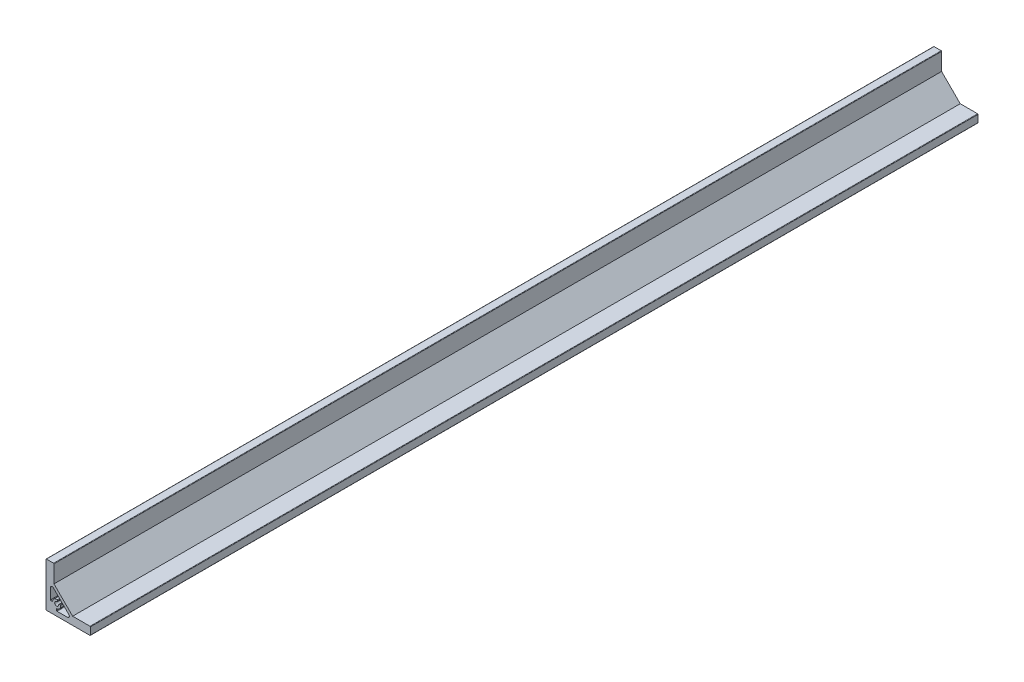
ISO-10303-21;
HEADER;
FILE_DESCRIPTION(('STEP AP214'),'2;1');
FILE_NAME('part.step','',(''),(''),'','','');
FILE_SCHEMA(('AUTOMOTIVE_DESIGN { 1 0 10303 214 1 1 1 1 }'));
ENDSEC;
DATA;
#1=APPLICATION_CONTEXT('core data for automotive mechanical design processes');
#2=APPLICATION_PROTOCOL_DEFINITION('international standard','automotive_design',2000,#1);
#3=PRODUCT_CONTEXT('',#1,'mechanical');
#4=PRODUCT('Part','Part','',(#3));
#5=PRODUCT_RELATED_PRODUCT_CATEGORY('part','',(#4));
#6=PRODUCT_DEFINITION_FORMATION('','',#4);
#7=PRODUCT_DEFINITION_CONTEXT('part definition',#1,'design');
#8=PRODUCT_DEFINITION('design','',#6,#7);
#9=PRODUCT_DEFINITION_SHAPE('','',#8);
#10=(LENGTH_UNIT() NAMED_UNIT(*) SI_UNIT(.MILLI.,.METRE.));
#11=(NAMED_UNIT(*) PLANE_ANGLE_UNIT() SI_UNIT($,.RADIAN.));
#12=(NAMED_UNIT(*) SI_UNIT($,.STERADIAN.) SOLID_ANGLE_UNIT());
#13=UNCERTAINTY_MEASURE_WITH_UNIT(LENGTH_MEASURE(1.E-05),#10,'distance_accuracy_value','');
#14=(GEOMETRIC_REPRESENTATION_CONTEXT(3) GLOBAL_UNCERTAINTY_ASSIGNED_CONTEXT((#13)) GLOBAL_UNIT_ASSIGNED_CONTEXT((#10,
#11,#12)) REPRESENTATION_CONTEXT('',''));
#15=CARTESIAN_POINT('',(0.,0.,0.));
#16=DIRECTION('',(0.,0.,1.));
#17=DIRECTION('',(1.,0.,0.));
#18=AXIS2_PLACEMENT_3D('',#15,#16,#17);
#19=CARTESIAN_POINT('',(0.,0.,1000.));
#20=DIRECTION('',(0.,0.,1.));
#21=DIRECTION('',(1.,0.,0.));
#22=AXIS2_PLACEMENT_3D('',#19,#20,#21);
#23=PLANE('',#22);
#24=DIRECTION('',(-1.,0.,0.));
#25=VECTOR('',#24,1.);
#26=CARTESIAN_POINT('',(8.99999999999999,50.,1000.));
#27=LINE('',#26,#25);
#28=CARTESIAN_POINT('',(8.49999999999999,50.,1000.));
#29=VERTEX_POINT('',#28);
#30=CARTESIAN_POINT('',(0.499999999999995,50.,1000.));
#31=VERTEX_POINT('',#30);
#32=EDGE_CURVE('E300',#29,#31,#27,.T.);
#33=ORIENTED_EDGE('',*,*,#32,.T.);
#34=CARTESIAN_POINT('',(0.499999999999995,49.5,1000.));
#35=DIRECTION('',(0.,0.,1.));
#36=DIRECTION('',(1.,0.,0.));
#37=AXIS2_PLACEMENT_3D('',#34,#35,#36);
#38=CIRCLE('',#37,0.5);
#39=CARTESIAN_POINT('',(0.,49.5,1000.));
#40=VERTEX_POINT('',#39);
#41=EDGE_CURVE('E362',#31,#40,#38,.T.);
#42=ORIENTED_EDGE('',*,*,#41,.T.);
#43=DIRECTION('',(0.,-1.,0.));
#44=VECTOR('',#43,1.);
#45=CARTESIAN_POINT('',(0.,50.,1000.));
#46=LINE('',#45,#44);
#47=CARTESIAN_POINT('',(0.,0.500000000000014,1000.));
#48=VERTEX_POINT('',#47);
#49=EDGE_CURVE('E303',#40,#48,#46,.T.);
#50=ORIENTED_EDGE('',*,*,#49,.T.);
#51=CARTESIAN_POINT('',(0.5,0.5,1000.));
#52=DIRECTION('',(0.,0.,1.));
#53=DIRECTION('',(1.,0.,0.));
#54=AXIS2_PLACEMENT_3D('',#51,#52,#53);
#55=CIRCLE('',#54,0.5);
#56=CARTESIAN_POINT('',(0.5,0.,1000.));
#57=VERTEX_POINT('',#56);
#58=EDGE_CURVE('E354',#48,#57,#55,.T.);
#59=ORIENTED_EDGE('',*,*,#58,.T.);
#60=DIRECTION('',(1.,0.,0.));
#61=VECTOR('',#60,1.);
#62=CARTESIAN_POINT('',(0.,0.,1000.));
#63=LINE('',#62,#61);
#64=CARTESIAN_POINT('',(49.5,0.,1000.));
#65=VERTEX_POINT('',#64);
#66=EDGE_CURVE('E286',#57,#65,#63,.T.);
#67=ORIENTED_EDGE('',*,*,#66,.T.);
#68=CARTESIAN_POINT('',(49.5,0.5,1000.));
#69=DIRECTION('',(0.,0.,1.));
#70=DIRECTION('',(1.,0.,0.));
#71=AXIS2_PLACEMENT_3D('',#68,#69,#70);
#72=CIRCLE('',#71,0.5);
#73=CARTESIAN_POINT('',(50.,0.5,1000.));
#74=VERTEX_POINT('',#73);
#75=EDGE_CURVE('E356',#65,#74,#72,.T.);
#76=ORIENTED_EDGE('',*,*,#75,.T.);
#77=DIRECTION('',(0.,1.,0.));
#78=VECTOR('',#77,1.);
#79=CARTESIAN_POINT('',(50.,0.,1000.));
#80=LINE('',#79,#78);
#81=CARTESIAN_POINT('',(50.,8.5,1000.));
#82=VERTEX_POINT('',#81);
#83=EDGE_CURVE('E289',#74,#82,#80,.T.);
#84=ORIENTED_EDGE('',*,*,#83,.T.);
#85=CARTESIAN_POINT('',(49.5,8.5,1000.));
#86=DIRECTION('',(0.,0.,1.));
#87=DIRECTION('',(1.,0.,0.));
#88=AXIS2_PLACEMENT_3D('',#85,#86,#87);
#89=CIRCLE('',#88,0.5);
#90=CARTESIAN_POINT('',(49.5,9.,1000.));
#91=VERTEX_POINT('',#90);
#92=EDGE_CURVE('E358',#82,#91,#89,.T.);
#93=ORIENTED_EDGE('',*,*,#92,.T.);
#94=DIRECTION('',(-1.,0.,0.));
#95=VECTOR('',#94,1.);
#96=CARTESIAN_POINT('',(50.,9.,1000.));
#97=LINE('',#96,#95);
#98=CARTESIAN_POINT('',(30.,9.,1000.));
#99=VERTEX_POINT('',#98);
#100=EDGE_CURVE('E293',#91,#99,#97,.T.);
#101=ORIENTED_EDGE('',*,*,#100,.T.);
#102=DIRECTION('',(-0.707106781186548,0.707106781186547,0.));
#103=VECTOR('',#102,1.);
#104=CARTESIAN_POINT('',(30.,9.,1000.));
#105=LINE('',#104,#103);
#106=CARTESIAN_POINT('',(8.99999999999999,30.,1000.));
#107=VERTEX_POINT('',#106);
#108=EDGE_CURVE('E295',#99,#107,#105,.T.);
#109=ORIENTED_EDGE('',*,*,#108,.T.);
#110=DIRECTION('',(0.,1.,0.));
#111=VECTOR('',#110,1.);
#112=CARTESIAN_POINT('',(8.99999999999999,30.,1000.));
#113=LINE('',#112,#111);
#114=CARTESIAN_POINT('',(8.99999999999999,49.5,1000.));
#115=VERTEX_POINT('',#114);
#116=EDGE_CURVE('E297',#107,#115,#113,.T.);
#117=ORIENTED_EDGE('',*,*,#116,.T.);
#118=CARTESIAN_POINT('',(8.49999999999999,49.5,1000.));
#119=DIRECTION('',(0.,0.,1.));
#120=DIRECTION('',(1.,0.,0.));
#121=AXIS2_PLACEMENT_3D('',#118,#119,#120);
#122=CIRCLE('',#121,0.5);
#123=EDGE_CURVE('E360',#115,#29,#122,.T.);
#124=ORIENTED_EDGE('',*,*,#123,.T.);
#125=EDGE_LOOP('',(#33,#42,#50,#59,#67,#76,#84,#93,#101,#109,#117,#124));
#126=FACE_BOUND('',#125,.T.);
#127=CARTESIAN_POINT('',(12.,12.,1000.));
#128=DIRECTION('',(0.,0.,-1.));
#129=DIRECTION('',(1.,0.,0.));
#130=AXIS2_PLACEMENT_3D('',#127,#128,#129);
#131=CIRCLE('',#130,4.5);
#132=CARTESIAN_POINT('',(16.4581599050562,12.6122174948079,1000.));
#133=VERTEX_POINT('',#132);
#134=CARTESIAN_POINT('',(12.,7.49999999999997,1000.));
#135=VERTEX_POINT('',#134);
#136=EDGE_CURVE('E251',#133,#135,#131,.T.);
#137=ORIENTED_EDGE('',*,*,#136,.F.);
#138=CARTESIAN_POINT('',(15.9628088044944,12.5441933287182,1000.));
#139=DIRECTION('',(0.,0.,1.));
#140=DIRECTION('',(1.,0.,0.));
#141=AXIS2_PLACEMENT_3D('',#138,#139,#140);
#142=CIRCLE('',#141,0.5);
#143=CARTESIAN_POINT('',(15.8333992819432,13.0271562418627,1000.));
#144=VERTEX_POINT('',#143);
#145=EDGE_CURVE('E369',#133,#144,#142,.T.);
#146=ORIENTED_EDGE('',*,*,#145,.T.);
#147=DIRECTION('',(0.965925826289068,0.258819045102522,0.));
#148=VECTOR('',#147,1.);
#149=CARTESIAN_POINT('',(16.3466662183008,13.1646857029613,1000.));
#150=LINE('',#149,#148);
#151=CARTESIAN_POINT('',(14.5628908328919,12.6867245289625,1000.));
#152=VERTEX_POINT('',#151);
#153=EDGE_CURVE('E248',#152,#144,#150,.T.);
#154=ORIENTED_EDGE('',*,*,#153,.F.);
#155=CARTESIAN_POINT('',(14.6923003554431,12.2037616158179,1000.));
#156=DIRECTION('',(0.,0.,1.));
#157=DIRECTION('',(1.,0.,0.));
#158=AXIS2_PLACEMENT_3D('',#155,#156,#157);
#159=CIRCLE('',#158,0.5);
#160=CARTESIAN_POINT('',(14.1937262155462,12.1660279832591,1000.));
#161=VERTEX_POINT('',#160);
#162=EDGE_CURVE('E364',#152,#161,#159,.T.);
#163=ORIENTED_EDGE('',*,*,#162,.T.);
#164=CARTESIAN_POINT('',(12.,12.,1000.));
#165=DIRECTION('',(0.,0.,1.));
#166=DIRECTION('',(1.,0.,0.));
#167=AXIS2_PLACEMENT_3D('',#164,#165,#166);
#168=CIRCLE('',#167,2.20000000000001);
#169=CARTESIAN_POINT('',(12.1660279832591,14.1937262155462,1000.));
#170=VERTEX_POINT('',#169);
#171=EDGE_CURVE('E242',#170,#161,#168,.T.);
#172=ORIENTED_EDGE('',*,*,#171,.F.);
#173=CARTESIAN_POINT('',(12.203761615818,14.6923003554431,1000.));
#174=DIRECTION('',(0.,0.,1.));
#175=DIRECTION('',(1.,0.,0.));
#176=AXIS2_PLACEMENT_3D('',#173,#174,#175);
#177=CIRCLE('',#176,0.5);
#178=CARTESIAN_POINT('',(12.6867245289625,14.5628908328919,1000.));
#179=VERTEX_POINT('',#178);
#180=EDGE_CURVE('E366',#170,#179,#177,.T.);
#181=ORIENTED_EDGE('',*,*,#180,.T.);
#182=DIRECTION('',(-0.258819045102518,-0.965925826289069,0.));
#183=VECTOR('',#182,1.);
#184=CARTESIAN_POINT('',(12.5694018992255,14.1250368178359,1000.));
#185=LINE('',#184,#183);
#186=CARTESIAN_POINT('',(13.0271562418627,15.8333992819432,1000.));
#187=VERTEX_POINT('',#186);
#188=EDGE_CURVE('E239',#187,#179,#185,.T.);
#189=ORIENTED_EDGE('',*,*,#188,.F.);
#190=CARTESIAN_POINT('',(12.5441933287182,15.9628088044944,1000.));
#191=DIRECTION('',(0.,0.,1.));
#192=DIRECTION('',(1.,0.,0.));
#193=AXIS2_PLACEMENT_3D('',#190,#191,#192);
#194=CIRCLE('',#193,0.5);
#195=CARTESIAN_POINT('',(12.6122174948079,16.4581599050562,1000.));
#196=VERTEX_POINT('',#195);
#197=EDGE_CURVE('E238',#187,#196,#194,.T.);
#198=ORIENTED_EDGE('',*,*,#197,.T.);
#199=CARTESIAN_POINT('',(12.,12.,1000.));
#200=DIRECTION('',(0.,0.,-1.));
#201=DIRECTION('',(1.,0.,0.));
#202=AXIS2_PLACEMENT_3D('',#199,#200,#201);
#203=CIRCLE('',#202,4.5);
#204=CARTESIAN_POINT('',(7.49999999999997,12.,1000.));
#205=VERTEX_POINT('',#204);
#206=EDGE_CURVE('E222',#205,#196,#203,.T.);
#207=ORIENTED_EDGE('',*,*,#206,.F.);
#208=DIRECTION('',(1.,0.,0.));
#209=VECTOR('',#208,1.);
#210=CARTESIAN_POINT('',(7.49999999999997,12.,1000.));
#211=LINE('',#210,#209);
#212=CARTESIAN_POINT('',(5.49999999999999,12.,1000.));
#213=VERTEX_POINT('',#212);
#214=EDGE_CURVE('E210',#213,#205,#211,.T.);
#215=ORIENTED_EDGE('',*,*,#214,.F.);
#216=CARTESIAN_POINT('',(5.49999999999999,12.5,1000.));
#217=DIRECTION('',(0.,0.,1.));
#218=DIRECTION('',(1.,0.,0.));
#219=AXIS2_PLACEMENT_3D('',#216,#217,#218);
#220=CIRCLE('',#219,0.5);
#221=CARTESIAN_POINT('',(4.99999999999999,12.5,1000.));
#222=VERTEX_POINT('',#221);
#223=EDGE_CURVE('E423',#213,#222,#220,.F.);
#224=ORIENTED_EDGE('',*,*,#223,.T.);
#225=DIRECTION('',(0.,-1.,0.));
#226=VECTOR('',#225,1.);
#227=CARTESIAN_POINT('',(4.99999999999999,12.,1000.));
#228=LINE('',#227,#226);
#229=CARTESIAN_POINT('',(4.99999999999999,24.3632467631853,1000.));
#230=VERTEX_POINT('',#229);
#231=EDGE_CURVE('E223',#230,#222,#228,.T.);
#232=ORIENTED_EDGE('',*,*,#231,.F.);
#233=CARTESIAN_POINT('',(6.99999999999999,24.3632467631853,1000.));
#234=DIRECTION('',(0.,0.,1.));
#235=DIRECTION('',(1.,0.,0.));
#236=AXIS2_PLACEMENT_3D('',#233,#234,#235);
#237=CIRCLE('',#236,2.);
#238=CARTESIAN_POINT('',(8.41421356237308,25.7774603255584,1000.));
#239=VERTEX_POINT('',#238);
#240=EDGE_CURVE('E9',#230,#239,#237,.F.);
#241=ORIENTED_EDGE('',*,*,#240,.T.);
#242=DIRECTION('',(-0.707106781186548,0.707106781186547,0.));
#243=VECTOR('',#242,1.);
#244=CARTESIAN_POINT('',(4.99999999999999,29.1916738879315,1000.));
#245=LINE('',#244,#243);
#246=CARTESIAN_POINT('',(25.7774603255584,8.4142135623731,1000.));
#247=VERTEX_POINT('',#246);
#248=EDGE_CURVE('E283',#247,#239,#245,.T.);
#249=ORIENTED_EDGE('',*,*,#248,.F.);
#250=CARTESIAN_POINT('',(24.3632467631853,7.,1000.));
#251=DIRECTION('',(0.,0.,1.));
#252=DIRECTION('',(1.,0.,0.));
#253=AXIS2_PLACEMENT_3D('',#250,#251,#252);
#254=CIRCLE('',#253,2.);
#255=CARTESIAN_POINT('',(24.3632467631853,5.,1000.));
#256=VERTEX_POINT('',#255);
#257=EDGE_CURVE('E436',#247,#256,#254,.F.);
#258=ORIENTED_EDGE('',*,*,#257,.T.);
#259=DIRECTION('',(1.,0.,0.));
#260=VECTOR('',#259,1.);
#261=CARTESIAN_POINT('',(29.1916738879315,5.,1000.));
#262=LINE('',#261,#260);
#263=CARTESIAN_POINT('',(12.5,5.,1000.));
#264=VERTEX_POINT('',#263);
#265=EDGE_CURVE('E256',#264,#256,#262,.T.);
#266=ORIENTED_EDGE('',*,*,#265,.F.);
#267=CARTESIAN_POINT('',(12.5,5.5,1000.));
#268=DIRECTION('',(0.,0.,1.));
#269=DIRECTION('',(1.,0.,0.));
#270=AXIS2_PLACEMENT_3D('',#267,#268,#269);
#271=CIRCLE('',#270,0.5);
#272=CARTESIAN_POINT('',(12.,5.5,1000.));
#273=VERTEX_POINT('',#272);
#274=EDGE_CURVE('E419',#264,#273,#271,.F.);
#275=ORIENTED_EDGE('',*,*,#274,.T.);
#276=DIRECTION('',(0.,-1.,0.));
#277=VECTOR('',#276,1.);
#278=CARTESIAN_POINT('',(12.,5.,1000.));
#279=LINE('',#278,#277);
#280=EDGE_CURVE('E253',#135,#273,#279,.T.);
#281=ORIENTED_EDGE('',*,*,#280,.F.);
#282=EDGE_LOOP('',(#137,#146,#154,#163,#172,#181,#189,#198,#207,#215,#224,#232,#241,#249,#258,
#266,#275,#281));
#283=FACE_BOUND('',#282,.T.);
#284=ADVANCED_FACE('F15',(#126,#283),#23,.T.);
#285=CARTESIAN_POINT('',(0.,0.,0.));
#286=DIRECTION('',(0.,0.,1.));
#287=DIRECTION('',(1.,0.,0.));
#288=AXIS2_PLACEMENT_3D('',#285,#286,#287);
#289=PLANE('',#288);
#290=DIRECTION('',(0.,-1.,0.));
#291=VECTOR('',#290,1.);
#292=CARTESIAN_POINT('',(0.,50.,0.));
#293=LINE('',#292,#291);
#294=CARTESIAN_POINT('',(0.,49.5,0.));
#295=VERTEX_POINT('',#294);
#296=CARTESIAN_POINT('',(0.,0.500000000000014,0.));
#297=VERTEX_POINT('',#296);
#298=EDGE_CURVE('E290',#295,#297,#293,.T.);
#299=ORIENTED_EDGE('',*,*,#298,.F.);
#300=CARTESIAN_POINT('',(0.499999999999995,49.5,0.));
#301=DIRECTION('',(0.,0.,1.));
#302=DIRECTION('',(1.,0.,0.));
#303=AXIS2_PLACEMENT_3D('',#300,#301,#302);
#304=CIRCLE('',#303,0.5);
#305=CARTESIAN_POINT('',(0.499999999999995,50.,0.));
#306=VERTEX_POINT('',#305);
#307=EDGE_CURVE('E342',#295,#306,#304,.F.);
#308=ORIENTED_EDGE('',*,*,#307,.T.);
#309=DIRECTION('',(-1.,0.,0.));
#310=VECTOR('',#309,1.);
#311=CARTESIAN_POINT('',(8.99999999999999,50.,0.));
#312=LINE('',#311,#310);
#313=CARTESIAN_POINT('',(8.49999999999999,50.,0.));
#314=VERTEX_POINT('',#313);
#315=EDGE_CURVE('E319',#314,#306,#312,.T.);
#316=ORIENTED_EDGE('',*,*,#315,.F.);
#317=CARTESIAN_POINT('',(8.49999999999999,49.5,0.));
#318=DIRECTION('',(0.,0.,1.));
#319=DIRECTION('',(1.,0.,0.));
#320=AXIS2_PLACEMENT_3D('',#317,#318,#319);
#321=CIRCLE('',#320,0.5);
#322=CARTESIAN_POINT('',(8.99999999999999,49.5,0.));
#323=VERTEX_POINT('',#322);
#324=EDGE_CURVE('E340',#314,#323,#321,.F.);
#325=ORIENTED_EDGE('',*,*,#324,.T.);
#326=DIRECTION('',(0.,1.,0.));
#327=VECTOR('',#326,1.);
#328=CARTESIAN_POINT('',(8.99999999999999,30.,0.));
#329=LINE('',#328,#327);
#330=CARTESIAN_POINT('',(8.99999999999999,30.,0.));
#331=VERTEX_POINT('',#330);
#332=EDGE_CURVE('E316',#331,#323,#329,.T.);
#333=ORIENTED_EDGE('',*,*,#332,.F.);
#334=DIRECTION('',(-0.707106781186548,0.707106781186547,0.));
#335=VECTOR('',#334,1.);
#336=CARTESIAN_POINT('',(30.,9.,0.));
#337=LINE('',#336,#335);
#338=CARTESIAN_POINT('',(30.,9.,0.));
#339=VERTEX_POINT('',#338);
#340=EDGE_CURVE('E314',#339,#331,#337,.T.);
#341=ORIENTED_EDGE('',*,*,#340,.F.);
#342=DIRECTION('',(-1.,0.,0.));
#343=VECTOR('',#342,1.);
#344=CARTESIAN_POINT('',(50.,9.,0.));
#345=LINE('',#344,#343);
#346=CARTESIAN_POINT('',(49.5,9.,0.));
#347=VERTEX_POINT('',#346);
#348=EDGE_CURVE('E312',#347,#339,#345,.T.);
#349=ORIENTED_EDGE('',*,*,#348,.F.);
#350=CARTESIAN_POINT('',(49.5,8.5,0.));
#351=DIRECTION('',(0.,0.,1.));
#352=DIRECTION('',(1.,0.,0.));
#353=AXIS2_PLACEMENT_3D('',#350,#351,#352);
#354=CIRCLE('',#353,0.5);
#355=CARTESIAN_POINT('',(50.,8.5,0.));
#356=VERTEX_POINT('',#355);
#357=EDGE_CURVE('E338',#347,#356,#354,.F.);
#358=ORIENTED_EDGE('',*,*,#357,.T.);
#359=DIRECTION('',(0.,1.,0.));
#360=VECTOR('',#359,1.);
#361=CARTESIAN_POINT('',(50.,0.,0.));
#362=LINE('',#361,#360);
#363=CARTESIAN_POINT('',(50.,0.5,0.));
#364=VERTEX_POINT('',#363);
#365=EDGE_CURVE('E309',#364,#356,#362,.T.);
#366=ORIENTED_EDGE('',*,*,#365,.F.);
#367=CARTESIAN_POINT('',(49.5,0.5,0.));
#368=DIRECTION('',(0.,0.,1.));
#369=DIRECTION('',(1.,0.,0.));
#370=AXIS2_PLACEMENT_3D('',#367,#368,#369);
#371=CIRCLE('',#370,0.5);
#372=CARTESIAN_POINT('',(49.5,0.,0.));
#373=VERTEX_POINT('',#372);
#374=EDGE_CURVE('E336',#364,#373,#371,.F.);
#375=ORIENTED_EDGE('',*,*,#374,.T.);
#376=DIRECTION('',(1.,0.,0.));
#377=VECTOR('',#376,1.);
#378=CARTESIAN_POINT('',(0.,0.,0.));
#379=LINE('',#378,#377);
#380=CARTESIAN_POINT('',(0.5,0.,0.));
#381=VERTEX_POINT('',#380);
#382=EDGE_CURVE('E232',#381,#373,#379,.T.);
#383=ORIENTED_EDGE('',*,*,#382,.F.);
#384=CARTESIAN_POINT('',(0.5,0.5,0.));
#385=DIRECTION('',(0.,0.,1.));
#386=DIRECTION('',(1.,0.,0.));
#387=AXIS2_PLACEMENT_3D('',#384,#385,#386);
#388=CIRCLE('',#387,0.5);
#389=EDGE_CURVE('E334',#381,#297,#388,.F.);
#390=ORIENTED_EDGE('',*,*,#389,.T.);
#391=EDGE_LOOP('',(#299,#308,#316,#325,#333,#341,#349,#358,#366,#375,#383,#390));
#392=FACE_BOUND('',#391,.T.);
#393=DIRECTION('',(0.965925826289068,0.258819045102522,0.));
#394=VECTOR('',#393,1.);
#395=CARTESIAN_POINT('',(16.3466662183008,13.1646857029613,0.));
#396=LINE('',#395,#394);
#397=CARTESIAN_POINT('',(14.5628908328919,12.6867245289625,0.));
#398=VERTEX_POINT('',#397);
#399=CARTESIAN_POINT('',(15.8333992819432,13.0271562418627,0.));
#400=VERTEX_POINT('',#399);
#401=EDGE_CURVE('E272',#398,#400,#396,.T.);
#402=ORIENTED_EDGE('',*,*,#401,.T.);
#403=CARTESIAN_POINT('',(15.9628088044944,12.5441933287182,0.));
#404=DIRECTION('',(0.,0.,1.));
#405=DIRECTION('',(1.,0.,0.));
#406=AXIS2_PLACEMENT_3D('',#403,#404,#405);
#407=CIRCLE('',#406,0.5);
#408=CARTESIAN_POINT('',(16.4581599050562,12.6122174948079,0.));
#409=VERTEX_POINT('',#408);
#410=EDGE_CURVE('E350',#400,#409,#407,.F.);
#411=ORIENTED_EDGE('',*,*,#410,.T.);
#412=CARTESIAN_POINT('',(12.,12.,0.));
#413=DIRECTION('',(0.,0.,-1.));
#414=DIRECTION('',(1.,0.,0.));
#415=AXIS2_PLACEMENT_3D('',#412,#413,#414);
#416=CIRCLE('',#415,4.5);
#417=CARTESIAN_POINT('',(12.,7.49999999999997,0.));
#418=VERTEX_POINT('',#417);
#419=EDGE_CURVE('E275',#409,#418,#416,.T.);
#420=ORIENTED_EDGE('',*,*,#419,.T.);
#421=DIRECTION('',(0.,-1.,0.));
#422=VECTOR('',#421,1.);
#423=CARTESIAN_POINT('',(12.,5.,0.));
#424=LINE('',#423,#422);
#425=CARTESIAN_POINT('',(12.,5.5,0.));
#426=VERTEX_POINT('',#425);
#427=EDGE_CURVE('E277',#418,#426,#424,.T.);
#428=ORIENTED_EDGE('',*,*,#427,.T.);
#429=CARTESIAN_POINT('',(12.5,5.5,0.));
#430=DIRECTION('',(0.,0.,1.));
#431=DIRECTION('',(1.,0.,0.));
#432=AXIS2_PLACEMENT_3D('',#429,#430,#431);
#433=CIRCLE('',#432,0.5);
#434=CARTESIAN_POINT('',(12.5,5.,0.));
#435=VERTEX_POINT('',#434);
#436=EDGE_CURVE('E417',#426,#435,#433,.T.);
#437=ORIENTED_EDGE('',*,*,#436,.T.);
#438=DIRECTION('',(1.,0.,0.));
#439=VECTOR('',#438,1.);
#440=CARTESIAN_POINT('',(29.1916738879315,5.,0.));
#441=LINE('',#440,#439);
#442=CARTESIAN_POINT('',(24.3632467631853,5.,0.));
#443=VERTEX_POINT('',#442);
#444=EDGE_CURVE('E280',#435,#443,#441,.T.);
#445=ORIENTED_EDGE('',*,*,#444,.T.);
#446=CARTESIAN_POINT('',(24.3632467631853,7.,0.));
#447=DIRECTION('',(0.,0.,1.));
#448=DIRECTION('',(1.,0.,0.));
#449=AXIS2_PLACEMENT_3D('',#446,#447,#448);
#450=CIRCLE('',#449,2.);
#451=CARTESIAN_POINT('',(25.7774603255584,8.4142135623731,0.));
#452=VERTEX_POINT('',#451);
#453=EDGE_CURVE('E434',#443,#452,#450,.T.);
#454=ORIENTED_EDGE('',*,*,#453,.T.);
#455=DIRECTION('',(-0.707106781186548,0.707106781186547,0.));
#456=VECTOR('',#455,1.);
#457=CARTESIAN_POINT('',(4.99999999999999,29.1916738879315,0.));
#458=LINE('',#457,#456);
#459=CARTESIAN_POINT('',(8.41421356237308,25.7774603255584,0.));
#460=VERTEX_POINT('',#459);
#461=EDGE_CURVE('E259',#452,#460,#458,.T.);
#462=ORIENTED_EDGE('',*,*,#461,.T.);
#463=CARTESIAN_POINT('',(6.99999999999999,24.3632467631853,0.));
#464=DIRECTION('',(0.,0.,1.));
#465=DIRECTION('',(1.,0.,0.));
#466=AXIS2_PLACEMENT_3D('',#463,#464,#465);
#467=CIRCLE('',#466,2.);
#468=CARTESIAN_POINT('',(4.99999999999999,24.3632467631853,0.));
#469=VERTEX_POINT('',#468);
#470=EDGE_CURVE('E23',#460,#469,#467,.T.);
#471=ORIENTED_EDGE('',*,*,#470,.T.);
#472=DIRECTION('',(0.,-1.,0.));
#473=VECTOR('',#472,1.);
#474=CARTESIAN_POINT('',(4.99999999999999,12.,0.));
#475=LINE('',#474,#473);
#476=CARTESIAN_POINT('',(4.99999999999999,12.5,0.));
#477=VERTEX_POINT('',#476);
#478=EDGE_CURVE('E261',#469,#477,#475,.T.);
#479=ORIENTED_EDGE('',*,*,#478,.T.);
#480=CARTESIAN_POINT('',(5.49999999999999,12.5,0.));
#481=DIRECTION('',(0.,0.,1.));
#482=DIRECTION('',(1.,0.,0.));
#483=AXIS2_PLACEMENT_3D('',#480,#481,#482);
#484=CIRCLE('',#483,0.5);
#485=CARTESIAN_POINT('',(5.49999999999999,12.,0.));
#486=VERTEX_POINT('',#485);
#487=EDGE_CURVE('E421',#477,#486,#484,.T.);
#488=ORIENTED_EDGE('',*,*,#487,.T.);
#489=DIRECTION('',(1.,0.,0.));
#490=VECTOR('',#489,1.);
#491=CARTESIAN_POINT('',(7.49999999999997,12.,0.));
#492=LINE('',#491,#490);
#493=CARTESIAN_POINT('',(7.49999999999997,12.,0.));
#494=VERTEX_POINT('',#493);
#495=EDGE_CURVE('E263',#486,#494,#492,.T.);
#496=ORIENTED_EDGE('',*,*,#495,.T.);
#497=CARTESIAN_POINT('',(12.,12.,0.));
#498=DIRECTION('',(0.,0.,-1.));
#499=DIRECTION('',(1.,0.,0.));
#500=AXIS2_PLACEMENT_3D('',#497,#498,#499);
#501=CIRCLE('',#500,4.5);
#502=CARTESIAN_POINT('',(12.6122174948079,16.4581599050562,0.));
#503=VERTEX_POINT('',#502);
#504=EDGE_CURVE('E231',#494,#503,#501,.T.);
#505=ORIENTED_EDGE('',*,*,#504,.T.);
#506=CARTESIAN_POINT('',(12.5441933287182,15.9628088044944,0.));
#507=DIRECTION('',(0.,0.,1.));
#508=DIRECTION('',(1.,0.,0.));
#509=AXIS2_PLACEMENT_3D('',#506,#507,#508);
#510=CIRCLE('',#509,0.5);
#511=CARTESIAN_POINT('',(13.0271562418627,15.8333992819432,0.));
#512=VERTEX_POINT('',#511);
#513=EDGE_CURVE('E348',#503,#512,#510,.F.);
#514=ORIENTED_EDGE('',*,*,#513,.T.);
#515=DIRECTION('',(-0.258819045102518,-0.965925826289069,0.));
#516=VECTOR('',#515,1.);
#517=CARTESIAN_POINT('',(12.5694018992255,14.1250368178359,0.));
#518=LINE('',#517,#516);
#519=CARTESIAN_POINT('',(12.6867245289625,14.5628908328919,0.));
#520=VERTEX_POINT('',#519);
#521=EDGE_CURVE('E266',#512,#520,#518,.T.);
#522=ORIENTED_EDGE('',*,*,#521,.T.);
#523=CARTESIAN_POINT('',(12.203761615818,14.6923003554431,0.));
#524=DIRECTION('',(0.,0.,1.));
#525=DIRECTION('',(1.,0.,0.));
#526=AXIS2_PLACEMENT_3D('',#523,#524,#525);
#527=CIRCLE('',#526,0.5);
#528=CARTESIAN_POINT('',(12.1660279832591,14.1937262155462,0.));
#529=VERTEX_POINT('',#528);
#530=EDGE_CURVE('E346',#520,#529,#527,.F.);
#531=ORIENTED_EDGE('',*,*,#530,.T.);
#532=CARTESIAN_POINT('',(12.,12.,0.));
#533=DIRECTION('',(0.,0.,1.));
#534=DIRECTION('',(1.,0.,0.));
#535=AXIS2_PLACEMENT_3D('',#532,#533,#534);
#536=CIRCLE('',#535,2.20000000000001);
#537=CARTESIAN_POINT('',(14.1937262155462,12.1660279832591,0.));
#538=VERTEX_POINT('',#537);
#539=EDGE_CURVE('E269',#529,#538,#536,.T.);
#540=ORIENTED_EDGE('',*,*,#539,.T.);
#541=CARTESIAN_POINT('',(14.6923003554431,12.2037616158179,0.));
#542=DIRECTION('',(0.,0.,1.));
#543=DIRECTION('',(1.,0.,0.));
#544=AXIS2_PLACEMENT_3D('',#541,#542,#543);
#545=CIRCLE('',#544,0.5);
#546=EDGE_CURVE('E344',#538,#398,#545,.F.);
#547=ORIENTED_EDGE('',*,*,#546,.T.);
#548=EDGE_LOOP('',(#402,#411,#420,#428,#437,#445,#454,#462,#471,#479,#488,#496,#505,#514,#522,
#531,#540,#547));
#549=FACE_BOUND('',#548,.T.);
#550=ADVANCED_FACE('F451',(#392,#549),#289,.F.);
#551=CARTESIAN_POINT('',(0.,0.,1000.));
#552=DIRECTION('',(0.,1.,0.));
#553=DIRECTION('',(0.,0.,1.));
#554=AXIS2_PLACEMENT_3D('',#551,#552,#553);
#555=PLANE('',#554);
#556=ORIENTED_EDGE('',*,*,#382,.T.);
#557=DIRECTION('',(0.,0.,-1.));
#558=VECTOR('',#557,1.);
#559=CARTESIAN_POINT('',(49.5,0.,1000.));
#560=LINE('',#559,#558);
#561=EDGE_CURVE('E415',#373,#65,#560,.F.);
#562=ORIENTED_EDGE('',*,*,#561,.T.);
#563=ORIENTED_EDGE('',*,*,#66,.F.);
#564=DIRECTION('',(0.,0.,-1.));
#565=VECTOR('',#564,1.);
#566=CARTESIAN_POINT('',(0.5,0.,1000.));
#567=LINE('',#566,#565);
#568=EDGE_CURVE('E412',#57,#381,#567,.T.);
#569=ORIENTED_EDGE('',*,*,#568,.T.);
#570=EDGE_LOOP('',(#556,#562,#563,#569));
#571=FACE_BOUND('',#570,.T.);
#572=ADVANCED_FACE('F489',(#571),#555,.F.);
#573=CARTESIAN_POINT('',(50.,0.,1000.));
#574=DIRECTION('',(-1.,0.,0.));
#575=DIRECTION('',(0.,0.,1.));
#576=AXIS2_PLACEMENT_3D('',#573,#574,#575);
#577=PLANE('',#576);
#578=ORIENTED_EDGE('',*,*,#365,.T.);
#579=DIRECTION('',(0.,0.,-1.));
#580=VECTOR('',#579,1.);
#581=CARTESIAN_POINT('',(50.,8.5,1000.));
#582=LINE('',#581,#580);
#583=EDGE_CURVE('E410',#356,#82,#582,.F.);
#584=ORIENTED_EDGE('',*,*,#583,.T.);
#585=ORIENTED_EDGE('',*,*,#83,.F.);
#586=DIRECTION('',(0.,0.,-1.));
#587=VECTOR('',#586,1.);
#588=CARTESIAN_POINT('',(50.,0.5,1000.));
#589=LINE('',#588,#587);
#590=EDGE_CURVE('E407',#74,#364,#589,.T.);
#591=ORIENTED_EDGE('',*,*,#590,.T.);
#592=EDGE_LOOP('',(#578,#584,#585,#591));
#593=FACE_BOUND('',#592,.T.);
#594=ADVANCED_FACE('F514',(#593),#577,.F.);
#595=CARTESIAN_POINT('',(50.,9.,1000.));
#596=DIRECTION('',(0.,-1.,0.));
#597=DIRECTION('',(0.,0.,-1.));
#598=AXIS2_PLACEMENT_3D('',#595,#596,#597);
#599=PLANE('',#598);
#600=ORIENTED_EDGE('',*,*,#100,.F.);
#601=DIRECTION('',(0.,0.,-1.));
#602=VECTOR('',#601,1.);
#603=CARTESIAN_POINT('',(49.5,9.,1000.));
#604=LINE('',#603,#602);
#605=EDGE_CURVE('E404',#91,#347,#604,.T.);
#606=ORIENTED_EDGE('',*,*,#605,.T.);
#607=ORIENTED_EDGE('',*,*,#348,.T.);
#608=DIRECTION('',(0.,0.,-1.));
#609=VECTOR('',#608,1.);
#610=CARTESIAN_POINT('',(30.,9.,1000.));
#611=LINE('',#610,#609);
#612=EDGE_CURVE('E326',#99,#339,#611,.T.);
#613=ORIENTED_EDGE('',*,*,#612,.F.);
#614=EDGE_LOOP('',(#600,#606,#607,#613));
#615=FACE_BOUND('',#614,.T.);
#616=ADVANCED_FACE('F510',(#615),#599,.F.);
#617=CARTESIAN_POINT('',(30.,9.,1000.));
#618=DIRECTION('',(-0.707106781186547,-0.707106781186548,0.));
#619=DIRECTION('',(0.707106781186548,-0.707106781186547,0.));
#620=AXIS2_PLACEMENT_3D('',#617,#618,#619);
#621=PLANE('',#620);
#622=ORIENTED_EDGE('',*,*,#340,.T.);
#623=DIRECTION('',(0.,0.,-1.));
#624=VECTOR('',#623,1.);
#625=CARTESIAN_POINT('',(8.99999999999999,30.,1000.));
#626=LINE('',#625,#624);
#627=EDGE_CURVE('E306',#107,#331,#626,.T.);
#628=ORIENTED_EDGE('',*,*,#627,.F.);
#629=ORIENTED_EDGE('',*,*,#108,.F.);
#630=ORIENTED_EDGE('',*,*,#612,.T.);
#631=EDGE_LOOP('',(#622,#628,#629,#630));
#632=FACE_BOUND('',#631,.T.);
#633=ADVANCED_FACE('F506',(#632),#621,.F.);
#634=CARTESIAN_POINT('',(8.99999999999999,30.,1000.));
#635=DIRECTION('',(-1.,0.,0.));
#636=DIRECTION('',(0.,0.,1.));
#637=AXIS2_PLACEMENT_3D('',#634,#635,#636);
#638=PLANE('',#637);
#639=ORIENTED_EDGE('',*,*,#332,.T.);
#640=DIRECTION('',(0.,0.,-1.));
#641=VECTOR('',#640,1.);
#642=CARTESIAN_POINT('',(8.99999999999999,49.5,1000.));
#643=LINE('',#642,#641);
#644=EDGE_CURVE('E402',#323,#115,#643,.F.);
#645=ORIENTED_EDGE('',*,*,#644,.T.);
#646=ORIENTED_EDGE('',*,*,#116,.F.);
#647=ORIENTED_EDGE('',*,*,#627,.T.);
#648=EDGE_LOOP('',(#639,#645,#646,#647));
#649=FACE_BOUND('',#648,.T.);
#650=ADVANCED_FACE('F502',(#649),#638,.F.);
#651=CARTESIAN_POINT('',(8.99999999999999,50.,1000.));
#652=DIRECTION('',(0.,-1.,0.));
#653=DIRECTION('',(0.,0.,-1.));
#654=AXIS2_PLACEMENT_3D('',#651,#652,#653);
#655=PLANE('',#654);
#656=ORIENTED_EDGE('',*,*,#315,.T.);
#657=DIRECTION('',(0.,0.,-1.));
#658=VECTOR('',#657,1.);
#659=CARTESIAN_POINT('',(0.499999999999995,50.,1000.));
#660=LINE('',#659,#658);
#661=EDGE_CURVE('E400',#306,#31,#660,.F.);
#662=ORIENTED_EDGE('',*,*,#661,.T.);
#663=ORIENTED_EDGE('',*,*,#32,.F.);
#664=DIRECTION('',(0.,0.,-1.));
#665=VECTOR('',#664,1.);
#666=CARTESIAN_POINT('',(8.49999999999999,50.,1000.));
#667=LINE('',#666,#665);
#668=EDGE_CURVE('E397',#29,#314,#667,.T.);
#669=ORIENTED_EDGE('',*,*,#668,.T.);
#670=EDGE_LOOP('',(#656,#662,#663,#669));
#671=FACE_BOUND('',#670,.T.);
#672=ADVANCED_FACE('F498',(#671),#655,.F.);
#673=CARTESIAN_POINT('',(0.,50.,1000.));
#674=DIRECTION('',(1.,0.,0.));
#675=DIRECTION('',(0.,1.,0.));
#676=AXIS2_PLACEMENT_3D('',#673,#674,#675);
#677=PLANE('',#676);
#678=ORIENTED_EDGE('',*,*,#49,.F.);
#679=DIRECTION('',(0.,0.,-1.));
#680=VECTOR('',#679,1.);
#681=CARTESIAN_POINT('',(0.,49.5,1000.));
#682=LINE('',#681,#680);
#683=EDGE_CURVE('E394',#40,#295,#682,.T.);
#684=ORIENTED_EDGE('',*,*,#683,.T.);
#685=ORIENTED_EDGE('',*,*,#298,.T.);
#686=DIRECTION('',(0.,0.,-1.));
#687=VECTOR('',#686,1.);
#688=CARTESIAN_POINT('',(0.,0.5,1000.));
#689=LINE('',#688,#687);
#690=EDGE_CURVE('E392',#297,#48,#689,.F.);
#691=ORIENTED_EDGE('',*,*,#690,.T.);
#692=EDGE_LOOP('',(#678,#684,#685,#691));
#693=FACE_BOUND('',#692,.T.);
#694=ADVANCED_FACE('F495',(#693),#677,.F.);
#695=CARTESIAN_POINT('',(4.99999999999999,29.1916738879315,1000.));
#696=DIRECTION('',(-0.707106781186547,-0.707106781186548,0.));
#697=DIRECTION('',(0.707106781186548,-0.707106781186547,0.));
#698=AXIS2_PLACEMENT_3D('',#695,#696,#697);
#699=PLANE('',#698);
#700=ORIENTED_EDGE('',*,*,#461,.F.);
#701=DIRECTION('',(0.,0.,-1.));
#702=VECTOR('',#701,1.);
#703=CARTESIAN_POINT('',(25.7774603255584,8.4142135623731,1000.));
#704=LINE('',#703,#702);
#705=EDGE_CURVE('E431',#452,#247,#704,.F.);
#706=ORIENTED_EDGE('',*,*,#705,.T.);
#707=ORIENTED_EDGE('',*,*,#248,.T.);
#708=DIRECTION('',(0.,0.,-1.));
#709=VECTOR('',#708,1.);
#710=CARTESIAN_POINT('',(8.41421356237308,25.7774603255584,0.));
#711=LINE('',#710,#709);
#712=EDGE_CURVE('E428',#239,#460,#711,.T.);
#713=ORIENTED_EDGE('',*,*,#712,.T.);
#714=EDGE_LOOP('',(#700,#706,#707,#713));
#715=FACE_BOUND('',#714,.T.);
#716=ADVANCED_FACE('F453',(#715),#699,.T.);
#717=CARTESIAN_POINT('',(4.99999999999999,12.,1000.));
#718=DIRECTION('',(1.,0.,0.));
#719=DIRECTION('',(0.,0.,-1.));
#720=AXIS2_PLACEMENT_3D('',#717,#718,#719);
#721=PLANE('',#720);
#722=ORIENTED_EDGE('',*,*,#478,.F.);
#723=DIRECTION('',(0.,0.,-1.));
#724=VECTOR('',#723,1.);
#725=CARTESIAN_POINT('',(4.99999999999999,24.3632467631853,1000.));
#726=LINE('',#725,#724);
#727=EDGE_CURVE('E36',#469,#230,#726,.F.);
#728=ORIENTED_EDGE('',*,*,#727,.T.);
#729=ORIENTED_EDGE('',*,*,#231,.T.);
#730=DIRECTION('',(0.,0.,-1.));
#731=VECTOR('',#730,1.);
#732=CARTESIAN_POINT('',(4.99999999999999,12.5,0.));
#733=LINE('',#732,#731);
#734=EDGE_CURVE('E383',#222,#477,#733,.T.);
#735=ORIENTED_EDGE('',*,*,#734,.T.);
#736=EDGE_LOOP('',(#722,#728,#729,#735));
#737=FACE_BOUND('',#736,.T.);
#738=ADVANCED_FACE('F459',(#737),#721,.T.);
#739=CARTESIAN_POINT('',(7.49999999999997,12.,1000.));
#740=DIRECTION('',(0.,1.,0.));
#741=DIRECTION('',(0.,0.,1.));
#742=AXIS2_PLACEMENT_3D('',#739,#740,#741);
#743=PLANE('',#742);
#744=ORIENTED_EDGE('',*,*,#495,.F.);
#745=DIRECTION('',(0.,0.,-1.));
#746=VECTOR('',#745,1.);
#747=CARTESIAN_POINT('',(5.49999999999999,12.,1000.));
#748=LINE('',#747,#746);
#749=EDGE_CURVE('E217',#486,#213,#748,.F.);
#750=ORIENTED_EDGE('',*,*,#749,.T.);
#751=ORIENTED_EDGE('',*,*,#214,.T.);
#752=DIRECTION('',(0.,0.,-1.));
#753=VECTOR('',#752,1.);
#754=CARTESIAN_POINT('',(7.49999999999997,12.,1000.));
#755=LINE('',#754,#753);
#756=EDGE_CURVE('E214',#205,#494,#755,.T.);
#757=ORIENTED_EDGE('',*,*,#756,.T.);
#758=EDGE_LOOP('',(#744,#750,#751,#757));
#759=FACE_BOUND('',#758,.T.);
#760=ADVANCED_FACE('F213',(#759),#743,.T.);
#761=CARTESIAN_POINT('',(12.,12.,1000.));
#762=DIRECTION('',(0.,0.,-1.));
#763=DIRECTION('',(-1.,0.,0.));
#764=AXIS2_PLACEMENT_3D('',#761,#762,#763);
#765=CYLINDRICAL_SURFACE('',#764,4.5);
#766=ORIENTED_EDGE('',*,*,#206,.T.);
#767=DIRECTION('',(0.,0.,-1.));
#768=VECTOR('',#767,1.);
#769=CARTESIAN_POINT('',(12.6122174948079,16.4581599050562,1000.));
#770=LINE('',#769,#768);
#771=EDGE_CURVE('E371',#196,#503,#770,.T.);
#772=ORIENTED_EDGE('',*,*,#771,.T.);
#773=ORIENTED_EDGE('',*,*,#504,.F.);
#774=ORIENTED_EDGE('',*,*,#756,.F.);
#775=EDGE_LOOP('',(#766,#772,#773,#774));
#776=FACE_BOUND('',#775,.T.);
#777=ADVANCED_FACE('F227',(#776),#765,.T.);
#778=CARTESIAN_POINT('',(12.5694018992255,14.1250368178359,1000.));
#779=DIRECTION('',(0.965925826289069,-0.258819045102518,0.));
#780=DIRECTION('',(0.258819045102518,0.965925826289069,0.));
#781=AXIS2_PLACEMENT_3D('',#778,#779,#780);
#782=PLANE('',#781);
#783=ORIENTED_EDGE('',*,*,#521,.F.);
#784=DIRECTION('',(0.,0.,-1.));
#785=VECTOR('',#784,1.);
#786=CARTESIAN_POINT('',(13.0271562418627,15.8333992819432,1000.));
#787=LINE('',#786,#785);
#788=EDGE_CURVE('E376',#512,#187,#787,.F.);
#789=ORIENTED_EDGE('',*,*,#788,.T.);
#790=ORIENTED_EDGE('',*,*,#188,.T.);
#791=DIRECTION('',(0.,0.,-1.));
#792=VECTOR('',#791,1.);
#793=CARTESIAN_POINT('',(12.6867245289625,14.5628908328919,1000.));
#794=LINE('',#793,#792);
#795=EDGE_CURVE('E373',#179,#520,#794,.T.);
#796=ORIENTED_EDGE('',*,*,#795,.T.);
#797=EDGE_LOOP('',(#783,#789,#790,#796));
#798=FACE_BOUND('',#797,.T.);
#799=ADVANCED_FACE('F467',(#798),#782,.T.);
#800=CARTESIAN_POINT('',(12.,12.,1000.));
#801=DIRECTION('',(0.,0.,-1.));
#802=DIRECTION('',(-1.,0.,0.));
#803=AXIS2_PLACEMENT_3D('',#800,#801,#802);
#804=CYLINDRICAL_SURFACE('',#803,2.20000000000001);
#805=ORIENTED_EDGE('',*,*,#539,.F.);
#806=DIRECTION('',(0.,0.,-1.));
#807=VECTOR('',#806,1.);
#808=CARTESIAN_POINT('',(12.1660279832591,14.1937262155462,1000.));
#809=LINE('',#808,#807);
#810=EDGE_CURVE('E390',#529,#170,#809,.F.);
#811=ORIENTED_EDGE('',*,*,#810,.T.);
#812=ORIENTED_EDGE('',*,*,#171,.T.);
#813=DIRECTION('',(0.,0.,-1.));
#814=VECTOR('',#813,1.);
#815=CARTESIAN_POINT('',(14.1937262155462,12.1660279832591,1000.));
#816=LINE('',#815,#814);
#817=EDGE_CURVE('E387',#161,#538,#816,.T.);
#818=ORIENTED_EDGE('',*,*,#817,.T.);
#819=EDGE_LOOP('',(#805,#811,#812,#818));
#820=FACE_BOUND('',#819,.T.);
#821=ADVANCED_FACE('F683',(#820),#804,.F.);
#822=CARTESIAN_POINT('',(16.3466662183008,13.1646857029613,1000.));
#823=DIRECTION('',(-0.258819045102522,0.965925826289068,0.));
#824=DIRECTION('',(-0.965925826289068,-0.258819045102522,0.));
#825=AXIS2_PLACEMENT_3D('',#822,#823,#824);
#826=PLANE('',#825);
#827=ORIENTED_EDGE('',*,*,#153,.T.);
#828=DIRECTION('',(0.,0.,-1.));
#829=VECTOR('',#828,1.);
#830=CARTESIAN_POINT('',(15.8333992819432,13.0271562418627,1000.));
#831=LINE('',#830,#829);
#832=EDGE_CURVE('E331',#144,#400,#831,.T.);
#833=ORIENTED_EDGE('',*,*,#832,.T.);
#834=ORIENTED_EDGE('',*,*,#401,.F.);
#835=DIRECTION('',(0.,0.,-1.));
#836=VECTOR('',#835,1.);
#837=CARTESIAN_POINT('',(14.5628908328919,12.6867245289625,1000.));
#838=LINE('',#837,#836);
#839=EDGE_CURVE('E329',#398,#152,#838,.F.);
#840=ORIENTED_EDGE('',*,*,#839,.T.);
#841=EDGE_LOOP('',(#827,#833,#834,#840));
#842=FACE_BOUND('',#841,.T.);
#843=ADVANCED_FACE('F674',(#842),#826,.T.);
#844=CARTESIAN_POINT('',(12.,12.,1000.));
#845=DIRECTION('',(0.,0.,-1.));
#846=DIRECTION('',(-1.,0.,0.));
#847=AXIS2_PLACEMENT_3D('',#844,#845,#846);
#848=CYLINDRICAL_SURFACE('',#847,4.5);
#849=ORIENTED_EDGE('',*,*,#419,.F.);
#850=DIRECTION('',(0.,0.,-1.));
#851=VECTOR('',#850,1.);
#852=CARTESIAN_POINT('',(16.4581599050562,12.6122174948079,1000.));
#853=LINE('',#852,#851);
#854=EDGE_CURVE('E352',#409,#133,#853,.F.);
#855=ORIENTED_EDGE('',*,*,#854,.T.);
#856=ORIENTED_EDGE('',*,*,#136,.T.);
#857=DIRECTION('',(0.,0.,-1.));
#858=VECTOR('',#857,1.);
#859=CARTESIAN_POINT('',(12.,7.49999999999997,1000.));
#860=LINE('',#859,#858);
#861=EDGE_CURVE('E233',#135,#418,#860,.T.);
#862=ORIENTED_EDGE('',*,*,#861,.T.);
#863=EDGE_LOOP('',(#849,#855,#856,#862));
#864=FACE_BOUND('',#863,.T.);
#865=ADVANCED_FACE('F665',(#864),#848,.T.);
#866=CARTESIAN_POINT('',(12.,5.,1000.));
#867=DIRECTION('',(1.,0.,0.));
#868=DIRECTION('',(0.,0.,-1.));
#869=AXIS2_PLACEMENT_3D('',#866,#867,#868);
#870=PLANE('',#869);
#871=ORIENTED_EDGE('',*,*,#280,.T.);
#872=DIRECTION('',(0.,0.,-1.));
#873=VECTOR('',#872,1.);
#874=CARTESIAN_POINT('',(12.,5.5,0.));
#875=LINE('',#874,#873);
#876=EDGE_CURVE('E378',#273,#426,#875,.T.);
#877=ORIENTED_EDGE('',*,*,#876,.T.);
#878=ORIENTED_EDGE('',*,*,#427,.F.);
#879=ORIENTED_EDGE('',*,*,#861,.F.);
#880=EDGE_LOOP('',(#871,#877,#878,#879));
#881=FACE_BOUND('',#880,.T.);
#882=ADVANCED_FACE('F656',(#881),#870,.T.);
#883=CARTESIAN_POINT('',(29.1916738879315,5.,1000.));
#884=DIRECTION('',(0.,1.,0.));
#885=DIRECTION('',(0.,0.,1.));
#886=AXIS2_PLACEMENT_3D('',#883,#884,#885);
#887=PLANE('',#886);
#888=ORIENTED_EDGE('',*,*,#265,.T.);
#889=DIRECTION('',(0.,0.,-1.));
#890=VECTOR('',#889,1.);
#891=CARTESIAN_POINT('',(24.3632467631853,5.,0.));
#892=LINE('',#891,#890);
#893=EDGE_CURVE('E425',#256,#443,#892,.T.);
#894=ORIENTED_EDGE('',*,*,#893,.T.);
#895=ORIENTED_EDGE('',*,*,#444,.F.);
#896=DIRECTION('',(0.,0.,-1.));
#897=VECTOR('',#896,1.);
#898=CARTESIAN_POINT('',(12.5,5.,1000.));
#899=LINE('',#898,#897);
#900=EDGE_CURVE('E381',#435,#264,#899,.F.);
#901=ORIENTED_EDGE('',*,*,#900,.T.);
#902=EDGE_LOOP('',(#888,#894,#895,#901));
#903=FACE_BOUND('',#902,.T.);
#904=ADVANCED_FACE('F446',(#903),#887,.T.);
#905=CARTESIAN_POINT('',(15.9628088044944,12.5441933287182,1000.));
#906=DIRECTION('',(0.,0.,-1.));
#907=DIRECTION('',(-1.,0.,0.));
#908=AXIS2_PLACEMENT_3D('',#905,#906,#907);
#909=CYLINDRICAL_SURFACE('',#908,0.5);
#910=ORIENTED_EDGE('',*,*,#145,.F.);
#911=ORIENTED_EDGE('',*,*,#854,.F.);
#912=ORIENTED_EDGE('',*,*,#410,.F.);
#913=ORIENTED_EDGE('',*,*,#832,.F.);
#914=EDGE_LOOP('',(#910,#911,#912,#913));
#915=FACE_BOUND('',#914,.T.);
#916=ADVANCED_FACE('F472',(#915),#909,.T.);
#917=CARTESIAN_POINT('',(12.5441933287182,15.9628088044944,1000.));
#918=DIRECTION('',(0.,0.,-1.));
#919=DIRECTION('',(-1.,0.,0.));
#920=AXIS2_PLACEMENT_3D('',#917,#918,#919);
#921=CYLINDRICAL_SURFACE('',#920,0.5);
#922=ORIENTED_EDGE('',*,*,#197,.F.);
#923=ORIENTED_EDGE('',*,*,#788,.F.);
#924=ORIENTED_EDGE('',*,*,#513,.F.);
#925=ORIENTED_EDGE('',*,*,#771,.F.);
#926=EDGE_LOOP('',(#922,#923,#924,#925));
#927=FACE_BOUND('',#926,.T.);
#928=ADVANCED_FACE('F469',(#927),#921,.T.);
#929=CARTESIAN_POINT('',(12.5,5.5,1000.));
#930=DIRECTION('',(0.,0.,1.));
#931=DIRECTION('',(1.,0.,0.));
#932=AXIS2_PLACEMENT_3D('',#929,#930,#931);
#933=CYLINDRICAL_SURFACE('',#932,0.5);
#934=ORIENTED_EDGE('',*,*,#274,.F.);
#935=ORIENTED_EDGE('',*,*,#900,.F.);
#936=ORIENTED_EDGE('',*,*,#436,.F.);
#937=ORIENTED_EDGE('',*,*,#876,.F.);
#938=EDGE_LOOP('',(#934,#935,#936,#937));
#939=FACE_BOUND('',#938,.T.);
#940=ADVANCED_FACE('F471',(#939),#933,.F.);
#941=CARTESIAN_POINT('',(5.49999999999999,12.5,1000.));
#942=DIRECTION('',(0.,0.,1.));
#943=DIRECTION('',(1.,0.,0.));
#944=AXIS2_PLACEMENT_3D('',#941,#942,#943);
#945=CYLINDRICAL_SURFACE('',#944,0.5);
#946=ORIENTED_EDGE('',*,*,#223,.F.);
#947=ORIENTED_EDGE('',*,*,#749,.F.);
#948=ORIENTED_EDGE('',*,*,#487,.F.);
#949=ORIENTED_EDGE('',*,*,#734,.F.);
#950=EDGE_LOOP('',(#946,#947,#948,#949));
#951=FACE_BOUND('',#950,.T.);
#952=ADVANCED_FACE('F462',(#951),#945,.F.);
#953=CARTESIAN_POINT('',(12.203761615818,14.6923003554431,1000.));
#954=DIRECTION('',(0.,0.,-1.));
#955=DIRECTION('',(-1.,0.,0.));
#956=AXIS2_PLACEMENT_3D('',#953,#954,#955);
#957=CYLINDRICAL_SURFACE('',#956,0.5);
#958=ORIENTED_EDGE('',*,*,#180,.F.);
#959=ORIENTED_EDGE('',*,*,#810,.F.);
#960=ORIENTED_EDGE('',*,*,#530,.F.);
#961=ORIENTED_EDGE('',*,*,#795,.F.);
#962=EDGE_LOOP('',(#958,#959,#960,#961));
#963=FACE_BOUND('',#962,.T.);
#964=ADVANCED_FACE('F581',(#963),#957,.T.);
#965=CARTESIAN_POINT('',(14.6923003554431,12.2037616158179,1000.));
#966=DIRECTION('',(0.,0.,-1.));
#967=DIRECTION('',(-1.,0.,0.));
#968=AXIS2_PLACEMENT_3D('',#965,#966,#967);
#969=CYLINDRICAL_SURFACE('',#968,0.5);
#970=ORIENTED_EDGE('',*,*,#162,.F.);
#971=ORIENTED_EDGE('',*,*,#839,.F.);
#972=ORIENTED_EDGE('',*,*,#546,.F.);
#973=ORIENTED_EDGE('',*,*,#817,.F.);
#974=EDGE_LOOP('',(#970,#971,#972,#973));
#975=FACE_BOUND('',#974,.T.);
#976=ADVANCED_FACE('F578',(#975),#969,.T.);
#977=CARTESIAN_POINT('',(0.499999999999995,49.5,1000.));
#978=DIRECTION('',(0.,0.,-1.));
#979=DIRECTION('',(-1.,0.,0.));
#980=AXIS2_PLACEMENT_3D('',#977,#978,#979);
#981=CYLINDRICAL_SURFACE('',#980,0.5);
#982=ORIENTED_EDGE('',*,*,#41,.F.);
#983=ORIENTED_EDGE('',*,*,#661,.F.);
#984=ORIENTED_EDGE('',*,*,#307,.F.);
#985=ORIENTED_EDGE('',*,*,#683,.F.);
#986=EDGE_LOOP('',(#982,#983,#984,#985));
#987=FACE_BOUND('',#986,.T.);
#988=ADVANCED_FACE('F558',(#987),#981,.T.);
#989=CARTESIAN_POINT('',(8.49999999999999,49.5,1000.));
#990=DIRECTION('',(0.,0.,-1.));
#991=DIRECTION('',(-1.,0.,0.));
#992=AXIS2_PLACEMENT_3D('',#989,#990,#991);
#993=CYLINDRICAL_SURFACE('',#992,0.5);
#994=ORIENTED_EDGE('',*,*,#123,.F.);
#995=ORIENTED_EDGE('',*,*,#644,.F.);
#996=ORIENTED_EDGE('',*,*,#324,.F.);
#997=ORIENTED_EDGE('',*,*,#668,.F.);
#998=EDGE_LOOP('',(#994,#995,#996,#997));
#999=FACE_BOUND('',#998,.T.);
#1000=ADVANCED_FACE('F550',(#999),#993,.T.);
#1001=CARTESIAN_POINT('',(49.5,8.5,1000.));
#1002=DIRECTION('',(0.,0.,-1.));
#1003=DIRECTION('',(-1.,0.,0.));
#1004=AXIS2_PLACEMENT_3D('',#1001,#1002,#1003);
#1005=CYLINDRICAL_SURFACE('',#1004,0.5);
#1006=ORIENTED_EDGE('',*,*,#92,.F.);
#1007=ORIENTED_EDGE('',*,*,#583,.F.);
#1008=ORIENTED_EDGE('',*,*,#357,.F.);
#1009=ORIENTED_EDGE('',*,*,#605,.F.);
#1010=EDGE_LOOP('',(#1006,#1007,#1008,#1009));
#1011=FACE_BOUND('',#1010,.T.);
#1012=ADVANCED_FACE('F536',(#1011),#1005,.T.);
#1013=CARTESIAN_POINT('',(49.5,0.5,1000.));
#1014=DIRECTION('',(0.,0.,-1.));
#1015=DIRECTION('',(-1.,0.,0.));
#1016=AXIS2_PLACEMENT_3D('',#1013,#1014,#1015);
#1017=CYLINDRICAL_SURFACE('',#1016,0.5);
#1018=ORIENTED_EDGE('',*,*,#75,.F.);
#1019=ORIENTED_EDGE('',*,*,#561,.F.);
#1020=ORIENTED_EDGE('',*,*,#374,.F.);
#1021=ORIENTED_EDGE('',*,*,#590,.F.);
#1022=EDGE_LOOP('',(#1018,#1019,#1020,#1021));
#1023=FACE_BOUND('',#1022,.T.);
#1024=ADVANCED_FACE('F529',(#1023),#1017,.T.);
#1025=CARTESIAN_POINT('',(0.5,0.5,1000.));
#1026=DIRECTION('',(0.,0.,-1.));
#1027=DIRECTION('',(-1.,0.,0.));
#1028=AXIS2_PLACEMENT_3D('',#1025,#1026,#1027);
#1029=CYLINDRICAL_SURFACE('',#1028,0.5);
#1030=ORIENTED_EDGE('',*,*,#58,.F.);
#1031=ORIENTED_EDGE('',*,*,#690,.F.);
#1032=ORIENTED_EDGE('',*,*,#389,.F.);
#1033=ORIENTED_EDGE('',*,*,#568,.F.);
#1034=EDGE_LOOP('',(#1030,#1031,#1032,#1033));
#1035=FACE_BOUND('',#1034,.T.);
#1036=ADVANCED_FACE('F563',(#1035),#1029,.T.);
#1037=CARTESIAN_POINT('',(24.3632467631853,7.,1000.));
#1038=DIRECTION('',(0.,0.,1.));
#1039=DIRECTION('',(1.,0.,0.));
#1040=AXIS2_PLACEMENT_3D('',#1037,#1038,#1039);
#1041=CYLINDRICAL_SURFACE('',#1040,2.);
#1042=ORIENTED_EDGE('',*,*,#257,.F.);
#1043=ORIENTED_EDGE('',*,*,#705,.F.);
#1044=ORIENTED_EDGE('',*,*,#453,.F.);
#1045=ORIENTED_EDGE('',*,*,#893,.F.);
#1046=EDGE_LOOP('',(#1042,#1043,#1044,#1045));
#1047=FACE_BOUND('',#1046,.T.);
#1048=ADVANCED_FACE('F449',(#1047),#1041,.F.);
#1049=CARTESIAN_POINT('',(6.99999999999999,24.3632467631853,1000.));
#1050=DIRECTION('',(0.,0.,1.));
#1051=DIRECTION('',(1.,0.,0.));
#1052=AXIS2_PLACEMENT_3D('',#1049,#1050,#1051);
#1053=CYLINDRICAL_SURFACE('',#1052,2.);
#1054=ORIENTED_EDGE('',*,*,#240,.F.);
#1055=ORIENTED_EDGE('',*,*,#727,.F.);
#1056=ORIENTED_EDGE('',*,*,#470,.F.);
#1057=ORIENTED_EDGE('',*,*,#712,.F.);
#1058=EDGE_LOOP('',(#1054,#1055,#1056,#1057));
#1059=FACE_BOUND('',#1058,.T.);
#1060=ADVANCED_FACE('F17',(#1059),#1053,.F.);
#1061=CLOSED_SHELL('',(#284,#550,#572,#594,#616,#633,#650,#672,#694,#716,#738,#760,#777,#799,
#821,#843,#865,#882,#904,#916,#928,#940,#952,#964,#976,#988,#1000,#1012,#1024,#1036,#1048,#1060));
#1062=MANIFOLD_SOLID_BREP('B1',#1061);
#1063=ADVANCED_BREP_SHAPE_REPRESENTATION('',(#18,#1062),#14);
#1064=SHAPE_DEFINITION_REPRESENTATION(#9,#1063);
ENDSEC;
END-ISO-10303-21;
